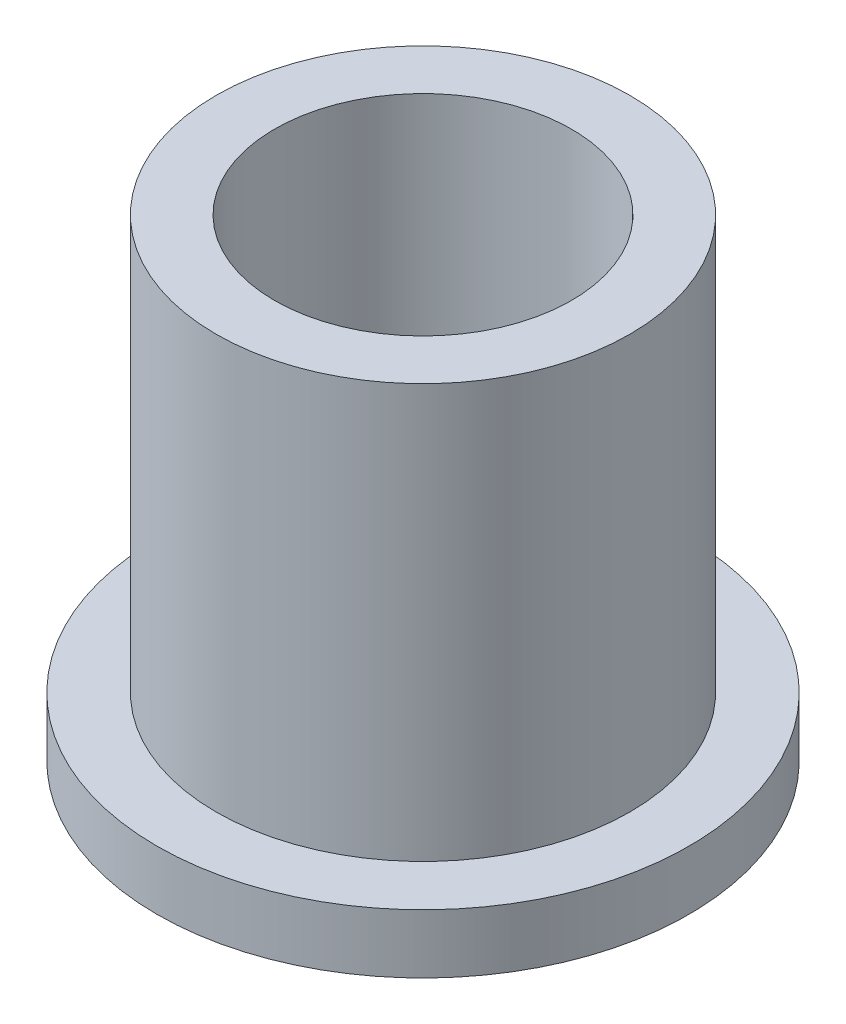
ISO-10303-21;
HEADER;
FILE_DESCRIPTION(('STEP AP214'),'2;1');
FILE_NAME('part.step','',(''),(''),'','','');
FILE_SCHEMA(('AUTOMOTIVE_DESIGN { 1 0 10303 214 1 1 1 1 }'));
ENDSEC;
DATA;
#1=APPLICATION_CONTEXT('core data for automotive mechanical design processes');
#2=APPLICATION_PROTOCOL_DEFINITION('international standard','automotive_design',2000,#1);
#3=PRODUCT_CONTEXT('',#1,'mechanical');
#4=PRODUCT('Part','Part','',(#3));
#5=PRODUCT_RELATED_PRODUCT_CATEGORY('part','',(#4));
#6=PRODUCT_DEFINITION_FORMATION('','',#4);
#7=PRODUCT_DEFINITION_CONTEXT('part definition',#1,'design');
#8=PRODUCT_DEFINITION('design','',#6,#7);
#9=PRODUCT_DEFINITION_SHAPE('','',#8);
#10=(LENGTH_UNIT() NAMED_UNIT(*) SI_UNIT(.MILLI.,.METRE.));
#11=(NAMED_UNIT(*) PLANE_ANGLE_UNIT() SI_UNIT($,.RADIAN.));
#12=(NAMED_UNIT(*) SI_UNIT($,.STERADIAN.) SOLID_ANGLE_UNIT());
#13=UNCERTAINTY_MEASURE_WITH_UNIT(LENGTH_MEASURE(1.E-05),#10,'distance_accuracy_value','');
#14=(GEOMETRIC_REPRESENTATION_CONTEXT(3) GLOBAL_UNCERTAINTY_ASSIGNED_CONTEXT((#13)) GLOBAL_UNIT_ASSIGNED_CONTEXT((#10,
#11,#12)) REPRESENTATION_CONTEXT('',''));
#15=CARTESIAN_POINT('',(0.,0.,0.));
#16=DIRECTION('',(0.,0.,1.));
#17=DIRECTION('',(1.,0.,0.));
#18=AXIS2_PLACEMENT_3D('',#15,#16,#17);
#19=CARTESIAN_POINT('',(0.,12.7,0.));
#20=DIRECTION('',(0.,1.,0.));
#21=DIRECTION('',(0.,0.,1.));
#22=AXIS2_PLACEMENT_3D('',#19,#20,#21);
#23=PLANE('',#22);
#24=CARTESIAN_POINT('',(0.,12.7,0.));
#25=DIRECTION('',(0.,1.,0.));
#26=DIRECTION('',(0.,0.,1.));
#27=AXIS2_PLACEMENT_3D('',#24,#25,#26);
#28=CIRCLE('',#27,5.55625);
#29=CARTESIAN_POINT('',(0.,12.7,5.55625));
#30=VERTEX_POINT('',#29);
#31=EDGE_CURVE('E10',#30,#30,#28,.T.);
#32=ORIENTED_EDGE('',*,*,#31,.T.);
#33=EDGE_LOOP('',(#32));
#34=FACE_BOUND('',#33,.T.);
#35=CARTESIAN_POINT('',(0.,12.7,0.));
#36=DIRECTION('',(0.,1.,0.));
#37=DIRECTION('',(0.,0.,1.));
#38=AXIS2_PLACEMENT_3D('',#35,#36,#37);
#39=CIRCLE('',#38,3.9878);
#40=CARTESIAN_POINT('',(0.,12.7,3.9878));
#41=VERTEX_POINT('',#40);
#42=EDGE_CURVE('E36',#41,#41,#39,.T.);
#43=ORIENTED_EDGE('',*,*,#42,.F.);
#44=EDGE_LOOP('',(#43));
#45=FACE_BOUND('',#44,.T.);
#46=ADVANCED_FACE('F29',(#34,#45),#23,.T.);
#47=CARTESIAN_POINT('',(0.,0.,0.));
#48=DIRECTION('',(0.,1.,0.));
#49=DIRECTION('',(0.,0.,1.));
#50=AXIS2_PLACEMENT_3D('',#47,#48,#49);
#51=PLANE('',#50);
#52=CARTESIAN_POINT('',(0.,0.,0.));
#53=DIRECTION('',(0.,1.,0.));
#54=DIRECTION('',(0.,0.,1.));
#55=AXIS2_PLACEMENT_3D('',#52,#53,#54);
#56=CIRCLE('',#55,3.9878);
#57=CARTESIAN_POINT('',(0.,0.,3.9878));
#58=VERTEX_POINT('',#57);
#59=EDGE_CURVE('E40',#58,#58,#56,.T.);
#60=ORIENTED_EDGE('',*,*,#59,.T.);
#61=EDGE_LOOP('',(#60));
#62=FACE_BOUND('',#61,.T.);
#63=CARTESIAN_POINT('',(0.,0.,0.));
#64=DIRECTION('',(0.,1.,0.));
#65=DIRECTION('',(0.,0.,1.));
#66=AXIS2_PLACEMENT_3D('',#63,#64,#65);
#67=CIRCLE('',#66,7.14375);
#68=CARTESIAN_POINT('',(0.,0.,7.14375));
#69=VERTEX_POINT('',#68);
#70=EDGE_CURVE('E47',#69,#69,#67,.T.);
#71=ORIENTED_EDGE('',*,*,#70,.F.);
#72=EDGE_LOOP('',(#71));
#73=FACE_BOUND('',#72,.T.);
#74=ADVANCED_FACE('F72',(#62,#73),#51,.F.);
#75=CARTESIAN_POINT('',(0.,12.7,0.));
#76=DIRECTION('',(0.,-1.,0.));
#77=DIRECTION('',(0.,0.,-1.));
#78=AXIS2_PLACEMENT_3D('',#75,#76,#77);
#79=CYLINDRICAL_SURFACE('',#78,5.55625);
#80=CARTESIAN_POINT('',(0.,1.5875,0.));
#81=DIRECTION('',(0.,1.,0.));
#82=DIRECTION('',(0.,0.,1.));
#83=AXIS2_PLACEMENT_3D('',#80,#81,#82);
#84=CIRCLE('',#83,5.55625);
#85=CARTESIAN_POINT('',(0.,1.5875,5.55625));
#86=VERTEX_POINT('',#85);
#87=EDGE_CURVE('E50',#86,#86,#84,.T.);
#88=ORIENTED_EDGE('',*,*,#87,.T.);
#89=EDGE_LOOP('',(#88));
#90=FACE_BOUND('',#89,.T.);
#91=ORIENTED_EDGE('',*,*,#31,.F.);
#92=EDGE_LOOP('',(#91));
#93=FACE_BOUND('',#92,.T.);
#94=ADVANCED_FACE('F31',(#90,#93),#79,.T.);
#95=CARTESIAN_POINT('',(0.,12.7,0.));
#96=DIRECTION('',(0.,-1.,0.));
#97=DIRECTION('',(0.,0.,-1.));
#98=AXIS2_PLACEMENT_3D('',#95,#96,#97);
#99=CYLINDRICAL_SURFACE('',#98,3.9878);
#100=ORIENTED_EDGE('',*,*,#42,.T.);
#101=EDGE_LOOP('',(#100));
#102=FACE_BOUND('',#101,.T.);
#103=ORIENTED_EDGE('',*,*,#59,.F.);
#104=EDGE_LOOP('',(#103));
#105=FACE_BOUND('',#104,.T.);
#106=ADVANCED_FACE('F61',(#102,#105),#99,.F.);
#107=CARTESIAN_POINT('',(0.,1.5875,0.));
#108=DIRECTION('',(0.,1.,0.));
#109=DIRECTION('',(0.,0.,1.));
#110=AXIS2_PLACEMENT_3D('',#107,#108,#109);
#111=PLANE('',#110);
#112=CARTESIAN_POINT('',(0.,1.5875,0.));
#113=DIRECTION('',(0.,1.,0.));
#114=DIRECTION('',(0.,0.,1.));
#115=AXIS2_PLACEMENT_3D('',#112,#113,#114);
#116=CIRCLE('',#115,7.14375);
#117=CARTESIAN_POINT('',(0.,1.5875,7.14375));
#118=VERTEX_POINT('',#117);
#119=EDGE_CURVE('E45',#118,#118,#116,.T.);
#120=ORIENTED_EDGE('',*,*,#119,.T.);
#121=EDGE_LOOP('',(#120));
#122=FACE_BOUND('',#121,.T.);
#123=ORIENTED_EDGE('',*,*,#87,.F.);
#124=EDGE_LOOP('',(#123));
#125=FACE_BOUND('',#124,.T.);
#126=ADVANCED_FACE('F58',(#122,#125),#111,.T.);
#127=CARTESIAN_POINT('',(0.,1.5875,0.));
#128=DIRECTION('',(0.,-1.,0.));
#129=DIRECTION('',(0.,0.,-1.));
#130=AXIS2_PLACEMENT_3D('',#127,#128,#129);
#131=CYLINDRICAL_SURFACE('',#130,7.14375);
#132=ORIENTED_EDGE('',*,*,#119,.F.);
#133=EDGE_LOOP('',(#132));
#134=FACE_BOUND('',#133,.T.);
#135=ORIENTED_EDGE('',*,*,#70,.T.);
#136=EDGE_LOOP('',(#135));
#137=FACE_BOUND('',#136,.T.);
#138=ADVANCED_FACE('F60',(#134,#137),#131,.T.);
#139=CLOSED_SHELL('',(#46,#74,#94,#106,#126,#138));
#140=MANIFOLD_SOLID_BREP('B2',#139);
#141=ADVANCED_BREP_SHAPE_REPRESENTATION('',(#18,#140),#14);
#142=SHAPE_DEFINITION_REPRESENTATION(#9,#141);
ENDSEC;
END-ISO-10303-21;
